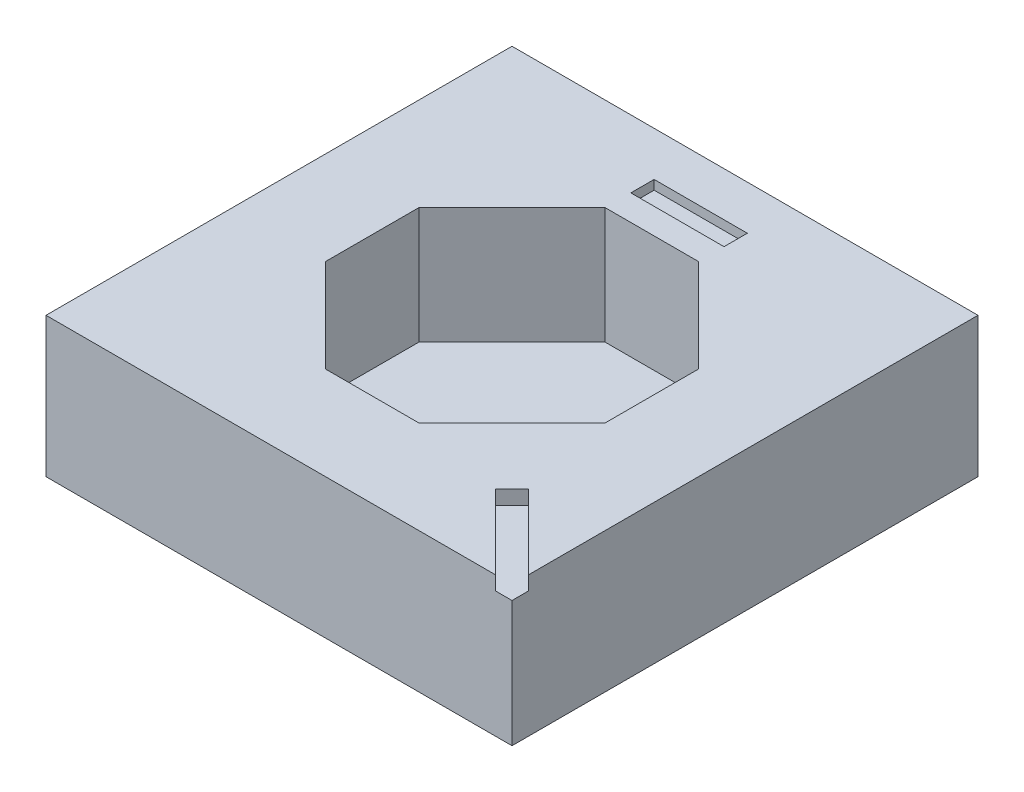
ISO-10303-21;
HEADER;
FILE_DESCRIPTION(('STEP AP214'),'2;1');
FILE_NAME('part.step','',(''),(''),'','','');
FILE_SCHEMA(('AUTOMOTIVE_DESIGN { 1 0 10303 214 1 1 1 1 }'));
ENDSEC;
DATA;
#1=APPLICATION_CONTEXT('core data for automotive mechanical design processes');
#2=APPLICATION_PROTOCOL_DEFINITION('international standard','automotive_design',2000,#1);
#3=PRODUCT_CONTEXT('',#1,'mechanical');
#4=PRODUCT('Part','Part','',(#3));
#5=PRODUCT_RELATED_PRODUCT_CATEGORY('part','',(#4));
#6=PRODUCT_DEFINITION_FORMATION('','',#4);
#7=PRODUCT_DEFINITION_CONTEXT('part definition',#1,'design');
#8=PRODUCT_DEFINITION('design','',#6,#7);
#9=PRODUCT_DEFINITION_SHAPE('','',#8);
#10=(LENGTH_UNIT() NAMED_UNIT(*) SI_UNIT(.MILLI.,.METRE.));
#11=(NAMED_UNIT(*) PLANE_ANGLE_UNIT() SI_UNIT($,.RADIAN.));
#12=(NAMED_UNIT(*) SI_UNIT($,.STERADIAN.) SOLID_ANGLE_UNIT());
#13=UNCERTAINTY_MEASURE_WITH_UNIT(LENGTH_MEASURE(1.E-05),#10,'distance_accuracy_value','');
#14=(GEOMETRIC_REPRESENTATION_CONTEXT(3) GLOBAL_UNCERTAINTY_ASSIGNED_CONTEXT((#13)) GLOBAL_UNIT_ASSIGNED_CONTEXT((#10,
#11,#12)) REPRESENTATION_CONTEXT('',''));
#15=CARTESIAN_POINT('',(0.,0.,0.));
#16=DIRECTION('',(0.,0.,1.));
#17=DIRECTION('',(1.,0.,0.));
#18=AXIS2_PLACEMENT_3D('',#15,#16,#17);
#19=CARTESIAN_POINT('',(50.,30.,-50.));
#20=DIRECTION('',(1.,0.,0.));
#21=DIRECTION('',(0.,0.,-1.));
#22=AXIS2_PLACEMENT_3D('',#19,#20,#21);
#23=PLANE('',#22);
#24=DIRECTION('',(0.,0.,1.));
#25=VECTOR('',#24,1.);
#26=CARTESIAN_POINT('',(50.,30.,-50.));
#27=LINE('',#26,#25);
#28=CARTESIAN_POINT('',(50.,30.,-50.));
#29=VERTEX_POINT('',#28);
#30=CARTESIAN_POINT('',(50.,30.,46.4644660940673));
#31=VERTEX_POINT('',#30);
#32=EDGE_CURVE('E294',#29,#31,#27,.T.);
#33=ORIENTED_EDGE('',*,*,#32,.T.);
#34=DIRECTION('',(0.,-1.,0.));
#35=VECTOR('',#34,1.);
#36=CARTESIAN_POINT('',(50.,30.,46.4644660940673));
#37=LINE('',#36,#35);
#38=CARTESIAN_POINT('',(50.,27.,46.4644660940673));
#39=VERTEX_POINT('',#38);
#40=EDGE_CURVE('E197',#31,#39,#37,.T.);
#41=ORIENTED_EDGE('',*,*,#40,.T.);
#42=DIRECTION('',(0.,0.,-1.));
#43=VECTOR('',#42,1.);
#44=CARTESIAN_POINT('',(50.,27.,-50.));
#45=LINE('',#44,#43);
#46=CARTESIAN_POINT('',(50.,27.,50.));
#47=VERTEX_POINT('',#46);
#48=EDGE_CURVE('E12',#47,#39,#45,.T.);
#49=ORIENTED_EDGE('',*,*,#48,.F.);
#50=DIRECTION('',(0.,-1.,0.));
#51=VECTOR('',#50,1.);
#52=CARTESIAN_POINT('',(50.,30.,50.));
#53=LINE('',#52,#51);
#54=CARTESIAN_POINT('',(50.,0.,50.));
#55=VERTEX_POINT('',#54);
#56=EDGE_CURVE('E309',#47,#55,#53,.T.);
#57=ORIENTED_EDGE('',*,*,#56,.T.);
#58=DIRECTION('',(0.,0.,1.));
#59=VECTOR('',#58,1.);
#60=CARTESIAN_POINT('',(50.,0.,-50.));
#61=LINE('',#60,#59);
#62=CARTESIAN_POINT('',(50.,0.,-50.));
#63=VERTEX_POINT('',#62);
#64=EDGE_CURVE('E289',#63,#55,#61,.T.);
#65=ORIENTED_EDGE('',*,*,#64,.F.);
#66=DIRECTION('',(0.,-1.,0.));
#67=VECTOR('',#66,1.);
#68=CARTESIAN_POINT('',(50.,30.,-50.));
#69=LINE('',#68,#67);
#70=EDGE_CURVE('E297',#29,#63,#69,.T.);
#71=ORIENTED_EDGE('',*,*,#70,.F.);
#72=EDGE_LOOP('',(#33,#41,#49,#57,#65,#71));
#73=FACE_BOUND('',#72,.T.);
#74=ADVANCED_FACE('F35',(#73),#23,.T.);
#75=CARTESIAN_POINT('',(0.,30.,0.));
#76=DIRECTION('',(0.,1.,0.));
#77=DIRECTION('',(0.,0.,1.));
#78=AXIS2_PLACEMENT_3D('',#75,#76,#77);
#79=PLANE('',#78);
#80=DIRECTION('',(1.,0.,0.));
#81=VECTOR('',#80,1.);
#82=CARTESIAN_POINT('',(-10.,30.,-35.5));
#83=LINE('',#82,#81);
#84=CARTESIAN_POINT('',(-10.,30.,-35.5));
#85=VERTEX_POINT('',#84);
#86=CARTESIAN_POINT('',(10.,30.,-35.5));
#87=VERTEX_POINT('',#86);
#88=EDGE_CURVE('E58',#85,#87,#83,.T.);
#89=ORIENTED_EDGE('',*,*,#88,.F.);
#90=DIRECTION('',(0.,0.,-1.));
#91=VECTOR('',#90,1.);
#92=CARTESIAN_POINT('',(-10.,30.,-35.5));
#93=LINE('',#92,#91);
#94=CARTESIAN_POINT('',(-10.,30.,-40.5));
#95=VERTEX_POINT('',#94);
#96=EDGE_CURVE('E205',#85,#95,#93,.T.);
#97=ORIENTED_EDGE('',*,*,#96,.T.);
#98=DIRECTION('',(1.,0.,0.));
#99=VECTOR('',#98,1.);
#100=CARTESIAN_POINT('',(-10.,30.,-40.5));
#101=LINE('',#100,#99);
#102=CARTESIAN_POINT('',(10.,30.,-40.5));
#103=VERTEX_POINT('',#102);
#104=EDGE_CURVE('E216',#95,#103,#101,.T.);
#105=ORIENTED_EDGE('',*,*,#104,.T.);
#106=DIRECTION('',(0.,0.,1.));
#107=VECTOR('',#106,1.);
#108=CARTESIAN_POINT('',(10.,30.,-40.5));
#109=LINE('',#108,#107);
#110=EDGE_CURVE('E213',#103,#87,#109,.T.);
#111=ORIENTED_EDGE('',*,*,#110,.T.);
#112=EDGE_LOOP('',(#89,#97,#105,#111));
#113=FACE_BOUND('',#112,.T.);
#114=DIRECTION('',(-1.,0.,0.));
#115=VECTOR('',#114,1.);
#116=CARTESIAN_POINT('',(9.99999999999999,30.,-30.));
#117=LINE('',#116,#115);
#118=CARTESIAN_POINT('',(9.99999999999999,30.,-30.));
#119=VERTEX_POINT('',#118);
#120=CARTESIAN_POINT('',(-10.,30.,-30.));
#121=VERTEX_POINT('',#120);
#122=EDGE_CURVE('E223',#119,#121,#117,.T.);
#123=ORIENTED_EDGE('',*,*,#122,.F.);
#124=DIRECTION('',(-0.707106781186548,0.,-0.707106781186547));
#125=VECTOR('',#124,1.);
#126=CARTESIAN_POINT('',(30.,30.,-10.));
#127=LINE('',#126,#125);
#128=CARTESIAN_POINT('',(30.,30.,-10.));
#129=VERTEX_POINT('',#128);
#130=EDGE_CURVE('E264',#129,#119,#127,.T.);
#131=ORIENTED_EDGE('',*,*,#130,.F.);
#132=DIRECTION('',(0.,0.,-1.));
#133=VECTOR('',#132,1.);
#134=CARTESIAN_POINT('',(30.,30.,10.));
#135=LINE('',#134,#133);
#136=CARTESIAN_POINT('',(30.,30.,10.));
#137=VERTEX_POINT('',#136);
#138=EDGE_CURVE('E261',#137,#129,#135,.T.);
#139=ORIENTED_EDGE('',*,*,#138,.F.);
#140=DIRECTION('',(0.707106781186548,0.,-0.707106781186548));
#141=VECTOR('',#140,1.);
#142=CARTESIAN_POINT('',(9.99999999999999,30.,30.));
#143=LINE('',#142,#141);
#144=CARTESIAN_POINT('',(9.99999999999999,30.,30.));
#145=VERTEX_POINT('',#144);
#146=EDGE_CURVE('E258',#145,#137,#143,.T.);
#147=ORIENTED_EDGE('',*,*,#146,.F.);
#148=DIRECTION('',(1.,0.,0.));
#149=VECTOR('',#148,1.);
#150=CARTESIAN_POINT('',(-10.,30.,30.));
#151=LINE('',#150,#149);
#152=CARTESIAN_POINT('',(-10.,30.,30.));
#153=VERTEX_POINT('',#152);
#154=EDGE_CURVE('E255',#153,#145,#151,.T.);
#155=ORIENTED_EDGE('',*,*,#154,.F.);
#156=DIRECTION('',(0.707106781186548,0.,0.707106781186547));
#157=VECTOR('',#156,1.);
#158=CARTESIAN_POINT('',(-30.,30.,10.));
#159=LINE('',#158,#157);
#160=CARTESIAN_POINT('',(-30.,30.,10.));
#161=VERTEX_POINT('',#160);
#162=EDGE_CURVE('E252',#161,#153,#159,.T.);
#163=ORIENTED_EDGE('',*,*,#162,.F.);
#164=DIRECTION('',(0.,0.,1.));
#165=VECTOR('',#164,1.);
#166=CARTESIAN_POINT('',(-30.,30.,-9.99999999999999));
#167=LINE('',#166,#165);
#168=CARTESIAN_POINT('',(-30.,30.,-9.99999999999999));
#169=VERTEX_POINT('',#168);
#170=EDGE_CURVE('E249',#169,#161,#167,.T.);
#171=ORIENTED_EDGE('',*,*,#170,.F.);
#172=DIRECTION('',(-0.707106781186547,0.,0.707106781186548));
#173=VECTOR('',#172,1.);
#174=CARTESIAN_POINT('',(-10.,30.,-30.));
#175=LINE('',#174,#173);
#176=EDGE_CURVE('E246',#121,#169,#175,.T.);
#177=ORIENTED_EDGE('',*,*,#176,.F.);
#178=EDGE_LOOP('',(#123,#131,#139,#147,#155,#163,#171,#177));
#179=FACE_BOUND('',#178,.T.);
#180=DIRECTION('',(-0.70710678118655,0.,0.707106781186545));
#181=VECTOR('',#180,1.);
#182=CARTESIAN_POINT('',(32.3223304703362,30.,32.3223304703364));
#183=LINE('',#182,#181);
#184=CARTESIAN_POINT('',(34.0900974233027,30.,30.5545635173699));
#185=VERTEX_POINT('',#184);
#186=CARTESIAN_POINT('',(30.55456351737,30.,34.0900974233027));
#187=VERTEX_POINT('',#186);
#188=EDGE_CURVE('E318',#185,#187,#183,.T.);
#189=ORIENTED_EDGE('',*,*,#188,.F.);
#190=DIRECTION('',(0.707106781186546,0.,0.707106781186549));
#191=VECTOR('',#190,1.);
#192=CARTESIAN_POINT('',(1.76776695296643,30.,-1.76776695296643));
#193=LINE('',#192,#191);
#194=EDGE_CURVE('E43',#185,#31,#193,.T.);
#195=ORIENTED_EDGE('',*,*,#194,.T.);
#196=ORIENTED_EDGE('',*,*,#32,.F.);
#197=DIRECTION('',(-1.,0.,0.));
#198=VECTOR('',#197,1.);
#199=CARTESIAN_POINT('',(50.,30.,-50.));
#200=LINE('',#199,#198);
#201=CARTESIAN_POINT('',(-50.,30.,-50.));
#202=VERTEX_POINT('',#201);
#203=EDGE_CURVE('E285',#29,#202,#200,.T.);
#204=ORIENTED_EDGE('',*,*,#203,.T.);
#205=DIRECTION('',(0.,0.,1.));
#206=VECTOR('',#205,1.);
#207=CARTESIAN_POINT('',(-50.,30.,-50.));
#208=LINE('',#207,#206);
#209=CARTESIAN_POINT('',(-50.,30.,50.));
#210=VERTEX_POINT('',#209);
#211=EDGE_CURVE('E288',#202,#210,#208,.T.);
#212=ORIENTED_EDGE('',*,*,#211,.T.);
#213=DIRECTION('',(-1.,0.,0.));
#214=VECTOR('',#213,1.);
#215=CARTESIAN_POINT('',(50.,30.,50.));
#216=LINE('',#215,#214);
#217=CARTESIAN_POINT('',(46.4644660940673,30.,50.));
#218=VERTEX_POINT('',#217);
#219=EDGE_CURVE('E292',#218,#210,#216,.T.);
#220=ORIENTED_EDGE('',*,*,#219,.F.);
#221=DIRECTION('',(0.707106781186546,0.,0.707106781186549));
#222=VECTOR('',#221,1.);
#223=CARTESIAN_POINT('',(-1.7677669529663,30.,1.7677669529663));
#224=LINE('',#223,#222);
#225=EDGE_CURVE('E316',#187,#218,#224,.T.);
#226=ORIENTED_EDGE('',*,*,#225,.F.);
#227=EDGE_LOOP('',(#189,#195,#196,#204,#212,#220,#226));
#228=FACE_BOUND('',#227,.T.);
#229=ADVANCED_FACE('F321',(#113,#179,#228),#79,.T.);
#230=CARTESIAN_POINT('',(50.,30.,-50.));
#231=DIRECTION('',(0.,0.,1.));
#232=DIRECTION('',(1.,0.,0.));
#233=AXIS2_PLACEMENT_3D('',#230,#231,#232);
#234=PLANE('',#233);
#235=DIRECTION('',(-1.,0.,0.));
#236=VECTOR('',#235,1.);
#237=CARTESIAN_POINT('',(50.,0.,-50.));
#238=LINE('',#237,#236);
#239=CARTESIAN_POINT('',(-50.,0.,-50.));
#240=VERTEX_POINT('',#239);
#241=EDGE_CURVE('E284',#63,#240,#238,.T.);
#242=ORIENTED_EDGE('',*,*,#241,.T.);
#243=DIRECTION('',(0.,-1.,0.));
#244=VECTOR('',#243,1.);
#245=CARTESIAN_POINT('',(-50.,30.,-50.));
#246=LINE('',#245,#244);
#247=EDGE_CURVE('E313',#202,#240,#246,.T.);
#248=ORIENTED_EDGE('',*,*,#247,.F.);
#249=ORIENTED_EDGE('',*,*,#203,.F.);
#250=ORIENTED_EDGE('',*,*,#70,.T.);
#251=EDGE_LOOP('',(#242,#248,#249,#250));
#252=FACE_BOUND('',#251,.T.);
#253=ADVANCED_FACE('F37',(#252),#234,.F.);
#254=CARTESIAN_POINT('',(-50.,30.,-50.));
#255=DIRECTION('',(1.,0.,0.));
#256=DIRECTION('',(0.,0.,-1.));
#257=AXIS2_PLACEMENT_3D('',#254,#255,#256);
#258=PLANE('',#257);
#259=DIRECTION('',(0.,0.,1.));
#260=VECTOR('',#259,1.);
#261=CARTESIAN_POINT('',(-50.,0.,-50.));
#262=LINE('',#261,#260);
#263=CARTESIAN_POINT('',(-50.,0.,50.));
#264=VERTEX_POINT('',#263);
#265=EDGE_CURVE('E300',#240,#264,#262,.T.);
#266=ORIENTED_EDGE('',*,*,#265,.T.);
#267=DIRECTION('',(0.,-1.,0.));
#268=VECTOR('',#267,1.);
#269=CARTESIAN_POINT('',(-50.,30.,50.));
#270=LINE('',#269,#268);
#271=EDGE_CURVE('E311',#210,#264,#270,.T.);
#272=ORIENTED_EDGE('',*,*,#271,.F.);
#273=ORIENTED_EDGE('',*,*,#211,.F.);
#274=ORIENTED_EDGE('',*,*,#247,.T.);
#275=EDGE_LOOP('',(#266,#272,#273,#274));
#276=FACE_BOUND('',#275,.T.);
#277=ADVANCED_FACE('F332',(#276),#258,.F.);
#278=CARTESIAN_POINT('',(50.,30.,50.));
#279=DIRECTION('',(0.,0.,1.));
#280=DIRECTION('',(1.,0.,0.));
#281=AXIS2_PLACEMENT_3D('',#278,#279,#280);
#282=PLANE('',#281);
#283=DIRECTION('',(0.,-1.,0.));
#284=VECTOR('',#283,1.);
#285=CARTESIAN_POINT('',(46.4644660940673,30.,50.));
#286=LINE('',#285,#284);
#287=CARTESIAN_POINT('',(46.4644660940673,27.,50.));
#288=VERTEX_POINT('',#287);
#289=EDGE_CURVE('E188',#218,#288,#286,.T.);
#290=ORIENTED_EDGE('',*,*,#289,.F.);
#291=ORIENTED_EDGE('',*,*,#219,.T.);
#292=ORIENTED_EDGE('',*,*,#271,.T.);
#293=DIRECTION('',(-1.,0.,0.));
#294=VECTOR('',#293,1.);
#295=CARTESIAN_POINT('',(50.,0.,50.));
#296=LINE('',#295,#294);
#297=EDGE_CURVE('E303',#55,#264,#296,.T.);
#298=ORIENTED_EDGE('',*,*,#297,.F.);
#299=ORIENTED_EDGE('',*,*,#56,.F.);
#300=DIRECTION('',(1.,0.,0.));
#301=VECTOR('',#300,1.);
#302=CARTESIAN_POINT('',(50.,27.,50.));
#303=LINE('',#302,#301);
#304=EDGE_CURVE('E199',#288,#47,#303,.T.);
#305=ORIENTED_EDGE('',*,*,#304,.F.);
#306=EDGE_LOOP('',(#290,#291,#292,#298,#299,#305));
#307=FACE_BOUND('',#306,.T.);
#308=ADVANCED_FACE('F336',(#307),#282,.T.);
#309=CARTESIAN_POINT('',(0.,0.,0.));
#310=DIRECTION('',(0.,1.,0.));
#311=DIRECTION('',(0.,0.,1.));
#312=AXIS2_PLACEMENT_3D('',#309,#310,#311);
#313=PLANE('',#312);
#314=ORIENTED_EDGE('',*,*,#241,.F.);
#315=ORIENTED_EDGE('',*,*,#64,.T.);
#316=ORIENTED_EDGE('',*,*,#297,.T.);
#317=ORIENTED_EDGE('',*,*,#265,.F.);
#318=EDGE_LOOP('',(#314,#315,#316,#317));
#319=FACE_BOUND('',#318,.T.);
#320=ADVANCED_FACE('F358',(#319),#313,.F.);
#321=CARTESIAN_POINT('',(9.99999999999999,-84.8528137423857,-30.));
#322=DIRECTION('',(0.,0.,-1.));
#323=DIRECTION('',(-1.,0.,0.));
#324=AXIS2_PLACEMENT_3D('',#321,#322,#323);
#325=PLANE('',#324);
#326=DIRECTION('',(1.,0.,0.));
#327=VECTOR('',#326,1.);
#328=CARTESIAN_POINT('',(9.99999999999999,5.,-30.));
#329=LINE('',#328,#327);
#330=CARTESIAN_POINT('',(-10.,5.,-30.));
#331=VERTEX_POINT('',#330);
#332=CARTESIAN_POINT('',(9.99999999999999,5.,-30.));
#333=VERTEX_POINT('',#332);
#334=EDGE_CURVE('E242',#331,#333,#329,.T.);
#335=ORIENTED_EDGE('',*,*,#334,.T.);
#336=DIRECTION('',(0.,1.,0.));
#337=VECTOR('',#336,1.);
#338=CARTESIAN_POINT('',(9.99999999999999,-84.8528137423857,-30.));
#339=LINE('',#338,#337);
#340=EDGE_CURVE('E232',#333,#119,#339,.T.);
#341=ORIENTED_EDGE('',*,*,#340,.T.);
#342=ORIENTED_EDGE('',*,*,#122,.T.);
#343=DIRECTION('',(0.,1.,0.));
#344=VECTOR('',#343,1.);
#345=CARTESIAN_POINT('',(-10.,-84.8528137423857,-30.));
#346=LINE('',#345,#344);
#347=EDGE_CURVE('E267',#331,#121,#346,.T.);
#348=ORIENTED_EDGE('',*,*,#347,.F.);
#349=EDGE_LOOP('',(#335,#341,#342,#348));
#350=FACE_BOUND('',#349,.T.);
#351=ADVANCED_FACE('F381',(#350),#325,.F.);
#352=CARTESIAN_POINT('',(30.,-84.8528137423857,-10.));
#353=DIRECTION('',(0.707106781186547,0.,-0.707106781186548));
#354=DIRECTION('',(-0.707106781186548,0.,-0.707106781186547));
#355=AXIS2_PLACEMENT_3D('',#352,#353,#354);
#356=PLANE('',#355);
#357=DIRECTION('',(0.707106781186548,0.,0.707106781186547));
#358=VECTOR('',#357,1.);
#359=CARTESIAN_POINT('',(30.,5.,-10.));
#360=LINE('',#359,#358);
#361=CARTESIAN_POINT('',(30.,5.,-9.99999999999999));
#362=VERTEX_POINT('',#361);
#363=EDGE_CURVE('E240',#333,#362,#360,.T.);
#364=ORIENTED_EDGE('',*,*,#363,.T.);
#365=DIRECTION('',(0.,1.,0.));
#366=VECTOR('',#365,1.);
#367=CARTESIAN_POINT('',(30.,-84.8528137423857,-10.));
#368=LINE('',#367,#366);
#369=EDGE_CURVE('E269',#362,#129,#368,.T.);
#370=ORIENTED_EDGE('',*,*,#369,.T.);
#371=ORIENTED_EDGE('',*,*,#130,.T.);
#372=ORIENTED_EDGE('',*,*,#340,.F.);
#373=EDGE_LOOP('',(#364,#370,#371,#372));
#374=FACE_BOUND('',#373,.T.);
#375=ADVANCED_FACE('F390',(#374),#356,.F.);
#376=CARTESIAN_POINT('',(30.,-84.8528137423857,10.));
#377=DIRECTION('',(1.,0.,0.));
#378=DIRECTION('',(0.,0.,-1.));
#379=AXIS2_PLACEMENT_3D('',#376,#377,#378);
#380=PLANE('',#379);
#381=DIRECTION('',(0.,0.,1.));
#382=VECTOR('',#381,1.);
#383=CARTESIAN_POINT('',(30.,5.,10.));
#384=LINE('',#383,#382);
#385=CARTESIAN_POINT('',(30.,5.,10.));
#386=VERTEX_POINT('',#385);
#387=EDGE_CURVE('E238',#362,#386,#384,.T.);
#388=ORIENTED_EDGE('',*,*,#387,.T.);
#389=DIRECTION('',(0.,1.,0.));
#390=VECTOR('',#389,1.);
#391=CARTESIAN_POINT('',(30.,-84.8528137423857,10.));
#392=LINE('',#391,#390);
#393=EDGE_CURVE('E271',#386,#137,#392,.T.);
#394=ORIENTED_EDGE('',*,*,#393,.T.);
#395=ORIENTED_EDGE('',*,*,#138,.T.);
#396=ORIENTED_EDGE('',*,*,#369,.F.);
#397=EDGE_LOOP('',(#388,#394,#395,#396));
#398=FACE_BOUND('',#397,.T.);
#399=ADVANCED_FACE('F400',(#398),#380,.F.);
#400=CARTESIAN_POINT('',(9.99999999999999,-84.8528137423857,30.));
#401=DIRECTION('',(0.707106781186548,0.,0.707106781186548));
#402=DIRECTION('',(0.707106781186548,0.,-0.707106781186548));
#403=AXIS2_PLACEMENT_3D('',#400,#401,#402);
#404=PLANE('',#403);
#405=DIRECTION('',(-0.707106781186548,0.,0.707106781186548));
#406=VECTOR('',#405,1.);
#407=CARTESIAN_POINT('',(9.99999999999999,5.,30.));
#408=LINE('',#407,#406);
#409=CARTESIAN_POINT('',(9.99999999999999,5.,30.));
#410=VERTEX_POINT('',#409);
#411=EDGE_CURVE('E236',#386,#410,#408,.T.);
#412=ORIENTED_EDGE('',*,*,#411,.T.);
#413=DIRECTION('',(0.,1.,0.));
#414=VECTOR('',#413,1.);
#415=CARTESIAN_POINT('',(9.99999999999999,-84.8528137423857,30.));
#416=LINE('',#415,#414);
#417=EDGE_CURVE('E273',#410,#145,#416,.T.);
#418=ORIENTED_EDGE('',*,*,#417,.T.);
#419=ORIENTED_EDGE('',*,*,#146,.T.);
#420=ORIENTED_EDGE('',*,*,#393,.F.);
#421=EDGE_LOOP('',(#412,#418,#419,#420));
#422=FACE_BOUND('',#421,.T.);
#423=ADVANCED_FACE('F410',(#422),#404,.F.);
#424=CARTESIAN_POINT('',(-10.,-84.8528137423857,30.));
#425=DIRECTION('',(0.,0.,1.));
#426=DIRECTION('',(1.,0.,0.));
#427=AXIS2_PLACEMENT_3D('',#424,#425,#426);
#428=PLANE('',#427);
#429=DIRECTION('',(-1.,0.,0.));
#430=VECTOR('',#429,1.);
#431=CARTESIAN_POINT('',(-10.,5.,30.));
#432=LINE('',#431,#430);
#433=CARTESIAN_POINT('',(-10.,5.,30.));
#434=VERTEX_POINT('',#433);
#435=EDGE_CURVE('E234',#410,#434,#432,.T.);
#436=ORIENTED_EDGE('',*,*,#435,.T.);
#437=DIRECTION('',(0.,1.,0.));
#438=VECTOR('',#437,1.);
#439=CARTESIAN_POINT('',(-10.,-84.8528137423857,30.));
#440=LINE('',#439,#438);
#441=EDGE_CURVE('E275',#434,#153,#440,.T.);
#442=ORIENTED_EDGE('',*,*,#441,.T.);
#443=ORIENTED_EDGE('',*,*,#154,.T.);
#444=ORIENTED_EDGE('',*,*,#417,.F.);
#445=EDGE_LOOP('',(#436,#442,#443,#444));
#446=FACE_BOUND('',#445,.T.);
#447=ADVANCED_FACE('F420',(#446),#428,.F.);
#448=CARTESIAN_POINT('',(-30.,-84.8528137423857,10.));
#449=DIRECTION('',(-0.707106781186547,0.,0.707106781186548));
#450=DIRECTION('',(0.707106781186548,0.,0.707106781186547));
#451=AXIS2_PLACEMENT_3D('',#448,#449,#450);
#452=PLANE('',#451);
#453=DIRECTION('',(-0.707106781186548,0.,-0.707106781186547));
#454=VECTOR('',#453,1.);
#455=CARTESIAN_POINT('',(-30.,5.,10.));
#456=LINE('',#455,#454);
#457=CARTESIAN_POINT('',(-30.,5.,10.));
#458=VERTEX_POINT('',#457);
#459=EDGE_CURVE('E231',#434,#458,#456,.T.);
#460=ORIENTED_EDGE('',*,*,#459,.T.);
#461=DIRECTION('',(0.,1.,0.));
#462=VECTOR('',#461,1.);
#463=CARTESIAN_POINT('',(-30.,-84.8528137423857,10.));
#464=LINE('',#463,#462);
#465=EDGE_CURVE('E277',#458,#161,#464,.T.);
#466=ORIENTED_EDGE('',*,*,#465,.T.);
#467=ORIENTED_EDGE('',*,*,#162,.T.);
#468=ORIENTED_EDGE('',*,*,#441,.F.);
#469=EDGE_LOOP('',(#460,#466,#467,#468));
#470=FACE_BOUND('',#469,.T.);
#471=ADVANCED_FACE('F430',(#470),#452,.F.);
#472=CARTESIAN_POINT('',(-30.,-84.8528137423857,-9.99999999999999));
#473=DIRECTION('',(-1.,0.,0.));
#474=DIRECTION('',(0.,0.,1.));
#475=AXIS2_PLACEMENT_3D('',#472,#473,#474);
#476=PLANE('',#475);
#477=DIRECTION('',(0.,0.,-1.));
#478=VECTOR('',#477,1.);
#479=CARTESIAN_POINT('',(-30.,5.,-9.99999999999999));
#480=LINE('',#479,#478);
#481=CARTESIAN_POINT('',(-30.,4.99999999999998,-9.99999999999999));
#482=VERTEX_POINT('',#481);
#483=EDGE_CURVE('E229',#458,#482,#480,.T.);
#484=ORIENTED_EDGE('',*,*,#483,.T.);
#485=DIRECTION('',(0.,1.,0.));
#486=VECTOR('',#485,1.);
#487=CARTESIAN_POINT('',(-30.,-84.8528137423857,-9.99999999999999));
#488=LINE('',#487,#486);
#489=EDGE_CURVE('E279',#482,#169,#488,.T.);
#490=ORIENTED_EDGE('',*,*,#489,.T.);
#491=ORIENTED_EDGE('',*,*,#170,.T.);
#492=ORIENTED_EDGE('',*,*,#465,.F.);
#493=EDGE_LOOP('',(#484,#490,#491,#492));
#494=FACE_BOUND('',#493,.T.);
#495=ADVANCED_FACE('F440',(#494),#476,.F.);
#496=CARTESIAN_POINT('',(-10.,-84.8528137423857,-30.));
#497=DIRECTION('',(-0.707106781186548,0.,-0.707106781186547));
#498=DIRECTION('',(-0.707106781186547,0.,0.707106781186548));
#499=AXIS2_PLACEMENT_3D('',#496,#497,#498);
#500=PLANE('',#499);
#501=DIRECTION('',(0.707106781186547,0.,-0.707106781186548));
#502=VECTOR('',#501,1.);
#503=CARTESIAN_POINT('',(-10.,5.,-30.));
#504=LINE('',#503,#502);
#505=EDGE_CURVE('E244',#482,#331,#504,.T.);
#506=ORIENTED_EDGE('',*,*,#505,.T.);
#507=ORIENTED_EDGE('',*,*,#347,.T.);
#508=ORIENTED_EDGE('',*,*,#176,.T.);
#509=ORIENTED_EDGE('',*,*,#489,.F.);
#510=EDGE_LOOP('',(#506,#507,#508,#509));
#511=FACE_BOUND('',#510,.T.);
#512=ADVANCED_FACE('F450',(#511),#500,.F.);
#513=CARTESIAN_POINT('',(0.,5.,0.));
#514=DIRECTION('',(0.,1.,0.));
#515=DIRECTION('',(0.,0.,1.));
#516=AXIS2_PLACEMENT_3D('',#513,#514,#515);
#517=PLANE('',#516);
#518=ORIENTED_EDGE('',*,*,#334,.F.);
#519=ORIENTED_EDGE('',*,*,#505,.F.);
#520=ORIENTED_EDGE('',*,*,#483,.F.);
#521=ORIENTED_EDGE('',*,*,#459,.F.);
#522=ORIENTED_EDGE('',*,*,#435,.F.);
#523=ORIENTED_EDGE('',*,*,#411,.F.);
#524=ORIENTED_EDGE('',*,*,#387,.F.);
#525=ORIENTED_EDGE('',*,*,#363,.F.);
#526=EDGE_LOOP('',(#518,#519,#520,#521,#522,#523,#524,#525));
#527=FACE_BOUND('',#526,.T.);
#528=ADVANCED_FACE('F460',(#527),#517,.T.);
#529=CARTESIAN_POINT('',(-10.,28.,-35.5));
#530=DIRECTION('',(0.,0.,1.));
#531=DIRECTION('',(1.,0.,0.));
#532=AXIS2_PLACEMENT_3D('',#529,#530,#531);
#533=PLANE('',#532);
#534=ORIENTED_EDGE('',*,*,#88,.T.);
#535=DIRECTION('',(0.,1.,0.));
#536=VECTOR('',#535,1.);
#537=CARTESIAN_POINT('',(10.,28.,-35.5));
#538=LINE('',#537,#536);
#539=CARTESIAN_POINT('',(10.,28.,-35.5));
#540=VERTEX_POINT('',#539);
#541=EDGE_CURVE('E211',#540,#87,#538,.T.);
#542=ORIENTED_EDGE('',*,*,#541,.F.);
#543=DIRECTION('',(1.,0.,0.));
#544=VECTOR('',#543,1.);
#545=CARTESIAN_POINT('',(-10.,28.,-35.5));
#546=LINE('',#545,#544);
#547=CARTESIAN_POINT('',(-10.,28.,-35.5));
#548=VERTEX_POINT('',#547);
#549=EDGE_CURVE('E201',#548,#540,#546,.T.);
#550=ORIENTED_EDGE('',*,*,#549,.F.);
#551=DIRECTION('',(0.,1.,0.));
#552=VECTOR('',#551,1.);
#553=CARTESIAN_POINT('',(-10.,28.,-35.5));
#554=LINE('',#553,#552);
#555=EDGE_CURVE('E221',#548,#85,#554,.T.);
#556=ORIENTED_EDGE('',*,*,#555,.T.);
#557=EDGE_LOOP('',(#534,#542,#550,#556));
#558=FACE_BOUND('',#557,.T.);
#559=ADVANCED_FACE('F470',(#558),#533,.F.);
#560=CARTESIAN_POINT('',(-10.,28.,-35.5));
#561=DIRECTION('',(1.,0.,0.));
#562=DIRECTION('',(0.,0.,-1.));
#563=AXIS2_PLACEMENT_3D('',#560,#561,#562);
#564=PLANE('',#563);
#565=ORIENTED_EDGE('',*,*,#96,.F.);
#566=ORIENTED_EDGE('',*,*,#555,.F.);
#567=DIRECTION('',(0.,0.,-1.));
#568=VECTOR('',#567,1.);
#569=CARTESIAN_POINT('',(-10.,28.,-35.5));
#570=LINE('',#569,#568);
#571=CARTESIAN_POINT('',(-10.,28.,-40.5));
#572=VERTEX_POINT('',#571);
#573=EDGE_CURVE('E209',#548,#572,#570,.T.);
#574=ORIENTED_EDGE('',*,*,#573,.T.);
#575=DIRECTION('',(0.,1.,0.));
#576=VECTOR('',#575,1.);
#577=CARTESIAN_POINT('',(-10.,28.,-40.5));
#578=LINE('',#577,#576);
#579=EDGE_CURVE('E224',#572,#95,#578,.T.);
#580=ORIENTED_EDGE('',*,*,#579,.T.);
#581=EDGE_LOOP('',(#565,#566,#574,#580));
#582=FACE_BOUND('',#581,.T.);
#583=ADVANCED_FACE('F480',(#582),#564,.T.);
#584=CARTESIAN_POINT('',(-10.,28.,-40.5));
#585=DIRECTION('',(0.,0.,1.));
#586=DIRECTION('',(1.,0.,0.));
#587=AXIS2_PLACEMENT_3D('',#584,#585,#586);
#588=PLANE('',#587);
#589=ORIENTED_EDGE('',*,*,#104,.F.);
#590=ORIENTED_EDGE('',*,*,#579,.F.);
#591=DIRECTION('',(1.,0.,0.));
#592=VECTOR('',#591,1.);
#593=CARTESIAN_POINT('',(-10.,28.,-40.5));
#594=LINE('',#593,#592);
#595=CARTESIAN_POINT('',(10.,28.,-40.5));
#596=VERTEX_POINT('',#595);
#597=EDGE_CURVE('E207',#572,#596,#594,.T.);
#598=ORIENTED_EDGE('',*,*,#597,.T.);
#599=DIRECTION('',(0.,1.,0.));
#600=VECTOR('',#599,1.);
#601=CARTESIAN_POINT('',(10.,28.,-40.5));
#602=LINE('',#601,#600);
#603=EDGE_CURVE('E226',#596,#103,#602,.T.);
#604=ORIENTED_EDGE('',*,*,#603,.T.);
#605=EDGE_LOOP('',(#589,#590,#598,#604));
#606=FACE_BOUND('',#605,.T.);
#607=ADVANCED_FACE('F489',(#606),#588,.T.);
#608=CARTESIAN_POINT('',(10.,28.,-40.5));
#609=DIRECTION('',(-1.,0.,0.));
#610=DIRECTION('',(0.,0.,1.));
#611=AXIS2_PLACEMENT_3D('',#608,#609,#610);
#612=PLANE('',#611);
#613=ORIENTED_EDGE('',*,*,#110,.F.);
#614=ORIENTED_EDGE('',*,*,#603,.F.);
#615=DIRECTION('',(0.,0.,1.));
#616=VECTOR('',#615,1.);
#617=CARTESIAN_POINT('',(10.,28.,-40.5));
#618=LINE('',#617,#616);
#619=EDGE_CURVE('E204',#596,#540,#618,.T.);
#620=ORIENTED_EDGE('',*,*,#619,.T.);
#621=ORIENTED_EDGE('',*,*,#541,.T.);
#622=EDGE_LOOP('',(#613,#614,#620,#621));
#623=FACE_BOUND('',#622,.T.);
#624=ADVANCED_FACE('F499',(#623),#612,.T.);
#625=CARTESIAN_POINT('',(0.,28.,0.));
#626=DIRECTION('',(0.,-1.,0.));
#627=DIRECTION('',(-1.,0.,0.));
#628=AXIS2_PLACEMENT_3D('',#625,#626,#627);
#629=PLANE('',#628);
#630=ORIENTED_EDGE('',*,*,#549,.T.);
#631=ORIENTED_EDGE('',*,*,#619,.F.);
#632=ORIENTED_EDGE('',*,*,#597,.F.);
#633=ORIENTED_EDGE('',*,*,#573,.F.);
#634=EDGE_LOOP('',(#630,#631,#632,#633));
#635=FACE_BOUND('',#634,.T.);
#636=ADVANCED_FACE('F508',(#635),#629,.F.);
#637=CARTESIAN_POINT('',(51.7677669529664,30.000012,48.2322330470337));
#638=DIRECTION('',(-0.707106781186549,0.,0.707106781186546));
#639=DIRECTION('',(0.707106781186546,0.,0.707106781186549));
#640=AXIS2_PLACEMENT_3D('',#637,#638,#639);
#641=PLANE('',#640);
#642=ORIENTED_EDGE('',*,*,#194,.F.);
#643=DIRECTION('',(0.,-1.,0.));
#644=VECTOR('',#643,1.);
#645=CARTESIAN_POINT('',(34.0900974233027,30.000012,30.5545635173699));
#646=LINE('',#645,#644);
#647=CARTESIAN_POINT('',(34.0900974233027,27.,30.5545635173699));
#648=VERTEX_POINT('',#647);
#649=EDGE_CURVE('E183',#185,#648,#646,.T.);
#650=ORIENTED_EDGE('',*,*,#649,.T.);
#651=DIRECTION('',(-0.707106781186546,0.,-0.707106781186549));
#652=VECTOR('',#651,1.);
#653=CARTESIAN_POINT('',(51.7677669529664,27.,48.2322330470337));
#654=LINE('',#653,#652);
#655=EDGE_CURVE('E172',#39,#648,#654,.T.);
#656=ORIENTED_EDGE('',*,*,#655,.F.);
#657=ORIENTED_EDGE('',*,*,#40,.F.);
#658=EDGE_LOOP('',(#642,#650,#656,#657));
#659=FACE_BOUND('',#658,.T.);
#660=ADVANCED_FACE('F184',(#659),#641,.T.);
#661=CARTESIAN_POINT('',(30.55456351737,30.000012,34.0900974233027));
#662=DIRECTION('',(-0.707106781186545,0.,-0.70710678118655));
#663=DIRECTION('',(-0.70710678118655,0.,0.707106781186545));
#664=AXIS2_PLACEMENT_3D('',#661,#662,#663);
#665=PLANE('',#664);
#666=ORIENTED_EDGE('',*,*,#188,.T.);
#667=DIRECTION('',(0.,-1.,0.));
#668=VECTOR('',#667,1.);
#669=CARTESIAN_POINT('',(30.55456351737,30.000012,34.0900974233027));
#670=LINE('',#669,#668);
#671=CARTESIAN_POINT('',(30.55456351737,27.,34.0900974233027));
#672=VERTEX_POINT('',#671);
#673=EDGE_CURVE('E50',#187,#672,#670,.T.);
#674=ORIENTED_EDGE('',*,*,#673,.T.);
#675=DIRECTION('',(0.70710678118655,0.,-0.707106781186545));
#676=VECTOR('',#675,1.);
#677=CARTESIAN_POINT('',(30.55456351737,27.,34.0900974233027));
#678=LINE('',#677,#676);
#679=EDGE_CURVE('E177',#672,#648,#678,.T.);
#680=ORIENTED_EDGE('',*,*,#679,.T.);
#681=ORIENTED_EDGE('',*,*,#649,.F.);
#682=EDGE_LOOP('',(#666,#674,#680,#681));
#683=FACE_BOUND('',#682,.T.);
#684=ADVANCED_FACE('F190',(#683),#665,.F.);
#685=CARTESIAN_POINT('',(48.2322330470336,30.000012,51.7677669529664));
#686=DIRECTION('',(-0.707106781186549,0.,0.707106781186546));
#687=DIRECTION('',(0.707106781186546,0.,0.707106781186549));
#688=AXIS2_PLACEMENT_3D('',#685,#686,#687);
#689=PLANE('',#688);
#690=ORIENTED_EDGE('',*,*,#289,.T.);
#691=DIRECTION('',(-0.707106781186546,0.,-0.707106781186549));
#692=VECTOR('',#691,1.);
#693=CARTESIAN_POINT('',(48.2322330470336,27.,51.7677669529664));
#694=LINE('',#693,#692);
#695=EDGE_CURVE('E191',#288,#672,#694,.T.);
#696=ORIENTED_EDGE('',*,*,#695,.T.);
#697=ORIENTED_EDGE('',*,*,#673,.F.);
#698=ORIENTED_EDGE('',*,*,#225,.T.);
#699=EDGE_LOOP('',(#690,#696,#697,#698));
#700=FACE_BOUND('',#699,.T.);
#701=ADVANCED_FACE('F339',(#700),#689,.F.);
#702=CARTESIAN_POINT('',(0.,27.,0.));
#703=DIRECTION('',(0.,-1.,0.));
#704=DIRECTION('',(-1.,0.,0.));
#705=AXIS2_PLACEMENT_3D('',#702,#703,#704);
#706=PLANE('',#705);
#707=ORIENTED_EDGE('',*,*,#304,.T.);
#708=ORIENTED_EDGE('',*,*,#48,.T.);
#709=ORIENTED_EDGE('',*,*,#655,.T.);
#710=ORIENTED_EDGE('',*,*,#679,.F.);
#711=ORIENTED_EDGE('',*,*,#695,.F.);
#712=EDGE_LOOP('',(#707,#708,#709,#710,#711));
#713=FACE_BOUND('',#712,.T.);
#714=ADVANCED_FACE('F174',(#713),#706,.F.);
#715=CLOSED_SHELL('',(#74,#229,#253,#277,#308,#320,#351,#375,#399,#423,#447,#471,#495,#512,#528,
#559,#583,#607,#624,#636,#660,#684,#701,#714));
#716=MANIFOLD_SOLID_BREP('B2',#715);
#717=ADVANCED_BREP_SHAPE_REPRESENTATION('',(#18,#716),#14);
#718=SHAPE_DEFINITION_REPRESENTATION(#9,#717);
ENDSEC;
END-ISO-10303-21;
